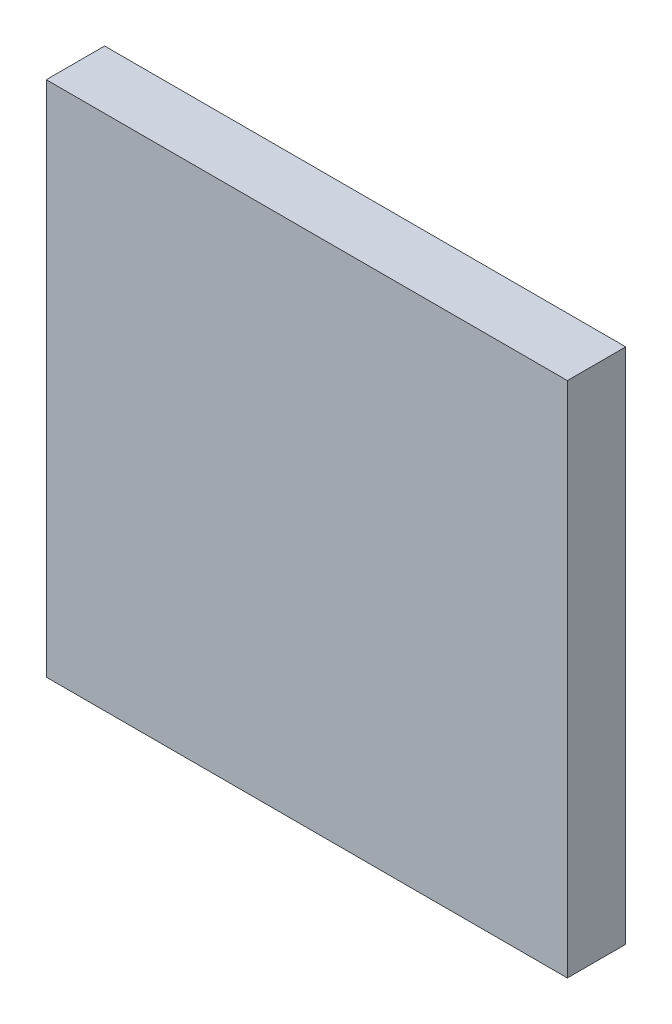
ISO-10303-21;
HEADER;
FILE_DESCRIPTION(('STEP AP214'),'2;1');
FILE_NAME('part.step','',(''),(''),'','','');
FILE_SCHEMA(('AUTOMOTIVE_DESIGN { 1 0 10303 214 1 1 1 1 }'));
ENDSEC;
DATA;
#1=APPLICATION_CONTEXT('core data for automotive mechanical design processes');
#2=APPLICATION_PROTOCOL_DEFINITION('international standard','automotive_design',2000,#1);
#3=PRODUCT_CONTEXT('',#1,'mechanical');
#4=PRODUCT('Part','Part','',(#3));
#5=PRODUCT_RELATED_PRODUCT_CATEGORY('part','',(#4));
#6=PRODUCT_DEFINITION_FORMATION('','',#4);
#7=PRODUCT_DEFINITION_CONTEXT('part definition',#1,'design');
#8=PRODUCT_DEFINITION('design','',#6,#7);
#9=PRODUCT_DEFINITION_SHAPE('','',#8);
#10=(LENGTH_UNIT() NAMED_UNIT(*) SI_UNIT(.MILLI.,.METRE.));
#11=(NAMED_UNIT(*) PLANE_ANGLE_UNIT() SI_UNIT($,.RADIAN.));
#12=(NAMED_UNIT(*) SI_UNIT($,.STERADIAN.) SOLID_ANGLE_UNIT());
#13=UNCERTAINTY_MEASURE_WITH_UNIT(LENGTH_MEASURE(1.E-05),#10,'distance_accuracy_value','');
#14=(GEOMETRIC_REPRESENTATION_CONTEXT(3) GLOBAL_UNCERTAINTY_ASSIGNED_CONTEXT((#13)) GLOBAL_UNIT_ASSIGNED_CONTEXT((#10,
#11,#12)) REPRESENTATION_CONTEXT('',''));
#15=CARTESIAN_POINT('',(0.,0.,0.));
#16=DIRECTION('',(0.,0.,1.));
#17=DIRECTION('',(1.,0.,0.));
#18=AXIS2_PLACEMENT_3D('',#15,#16,#17);
#19=CARTESIAN_POINT('',(-4.4635,-4.4,1.));
#20=DIRECTION('',(1.,0.,0.));
#21=DIRECTION('',(0.,0.,-1.));
#22=AXIS2_PLACEMENT_3D('',#19,#20,#21);
#23=PLANE('',#22);
#24=DIRECTION('',(0.,-1.,0.));
#25=VECTOR('',#24,1.);
#26=CARTESIAN_POINT('',(-4.4635,-4.4,0.));
#27=LINE('',#26,#25);
#28=CARTESIAN_POINT('',(-4.4635,4.4635,0.));
#29=VERTEX_POINT('',#28);
#30=CARTESIAN_POINT('',(-4.4635,-4.4,0.));
#31=VERTEX_POINT('',#30);
#32=EDGE_CURVE('E95',#29,#31,#27,.T.);
#33=ORIENTED_EDGE('',*,*,#32,.T.);
#34=DIRECTION('',(0.,0.,-1.));
#35=VECTOR('',#34,1.);
#36=CARTESIAN_POINT('',(-4.4635,-4.4,1.));
#37=LINE('',#36,#35);
#38=CARTESIAN_POINT('',(-4.4635,-4.4,1.));
#39=VERTEX_POINT('',#38);
#40=EDGE_CURVE('E11',#39,#31,#37,.T.);
#41=ORIENTED_EDGE('',*,*,#40,.F.);
#42=DIRECTION('',(0.,-1.,0.));
#43=VECTOR('',#42,1.);
#44=CARTESIAN_POINT('',(-4.4635,-4.4,1.));
#45=LINE('',#44,#43);
#46=CARTESIAN_POINT('',(-4.4635,4.4635,1.));
#47=VERTEX_POINT('',#46);
#48=EDGE_CURVE('E83',#47,#39,#45,.T.);
#49=ORIENTED_EDGE('',*,*,#48,.F.);
#50=DIRECTION('',(0.,0.,-1.));
#51=VECTOR('',#50,1.);
#52=CARTESIAN_POINT('',(-4.4635,4.4635,1.));
#53=LINE('',#52,#51);
#54=EDGE_CURVE('E91',#47,#29,#53,.T.);
#55=ORIENTED_EDGE('',*,*,#54,.T.);
#56=EDGE_LOOP('',(#33,#41,#49,#55));
#57=FACE_BOUND('',#56,.T.);
#58=ADVANCED_FACE('F32',(#57),#23,.F.);
#59=CARTESIAN_POINT('',(4.4635,-4.4,1.));
#60=DIRECTION('',(0.,1.,0.));
#61=DIRECTION('',(0.,0.,1.));
#62=AXIS2_PLACEMENT_3D('',#59,#60,#61);
#63=PLANE('',#62);
#64=DIRECTION('',(1.,0.,0.));
#65=VECTOR('',#64,1.);
#66=CARTESIAN_POINT('',(4.4635,-4.4,0.));
#67=LINE('',#66,#65);
#68=CARTESIAN_POINT('',(4.4635,-4.4,0.));
#69=VERTEX_POINT('',#68);
#70=EDGE_CURVE('E87',#31,#69,#67,.T.);
#71=ORIENTED_EDGE('',*,*,#70,.T.);
#72=DIRECTION('',(0.,0.,-1.));
#73=VECTOR('',#72,1.);
#74=CARTESIAN_POINT('',(4.4635,-4.4,1.));
#75=LINE('',#74,#73);
#76=CARTESIAN_POINT('',(4.4635,-4.4,1.));
#77=VERTEX_POINT('',#76);
#78=EDGE_CURVE('E40',#77,#69,#75,.T.);
#79=ORIENTED_EDGE('',*,*,#78,.F.);
#80=DIRECTION('',(1.,0.,0.));
#81=VECTOR('',#80,1.);
#82=CARTESIAN_POINT('',(4.4635,-4.4,1.));
#83=LINE('',#82,#81);
#84=EDGE_CURVE('E78',#39,#77,#83,.T.);
#85=ORIENTED_EDGE('',*,*,#84,.F.);
#86=ORIENTED_EDGE('',*,*,#40,.T.);
#87=EDGE_LOOP('',(#71,#79,#85,#86));
#88=FACE_BOUND('',#87,.T.);
#89=ADVANCED_FACE('F86',(#88),#63,.F.);
#90=CARTESIAN_POINT('',(4.4635,4.4635,1.));
#91=DIRECTION('',(-1.,0.,0.));
#92=DIRECTION('',(0.,0.,1.));
#93=AXIS2_PLACEMENT_3D('',#90,#91,#92);
#94=PLANE('',#93);
#95=DIRECTION('',(0.,1.,0.));
#96=VECTOR('',#95,1.);
#97=CARTESIAN_POINT('',(4.4635,4.4635,0.));
#98=LINE('',#97,#96);
#99=CARTESIAN_POINT('',(4.4635,4.4635,0.));
#100=VERTEX_POINT('',#99);
#101=EDGE_CURVE('E65',#69,#100,#98,.T.);
#102=ORIENTED_EDGE('',*,*,#101,.T.);
#103=DIRECTION('',(0.,0.,-1.));
#104=VECTOR('',#103,1.);
#105=CARTESIAN_POINT('',(4.4635,4.4635,1.));
#106=LINE('',#105,#104);
#107=CARTESIAN_POINT('',(4.4635,4.4635,1.));
#108=VERTEX_POINT('',#107);
#109=EDGE_CURVE('E88',#108,#100,#106,.T.);
#110=ORIENTED_EDGE('',*,*,#109,.F.);
#111=DIRECTION('',(0.,1.,0.));
#112=VECTOR('',#111,1.);
#113=CARTESIAN_POINT('',(4.4635,4.4635,1.));
#114=LINE('',#113,#112);
#115=EDGE_CURVE('E81',#77,#108,#114,.T.);
#116=ORIENTED_EDGE('',*,*,#115,.F.);
#117=ORIENTED_EDGE('',*,*,#78,.T.);
#118=EDGE_LOOP('',(#102,#110,#116,#117));
#119=FACE_BOUND('',#118,.T.);
#120=ADVANCED_FACE('F89',(#119),#94,.F.);
#121=CARTESIAN_POINT('',(-4.4635,4.4635,1.));
#122=DIRECTION('',(0.,-1.,0.));
#123=DIRECTION('',(0.,0.,-1.));
#124=AXIS2_PLACEMENT_3D('',#121,#122,#123);
#125=PLANE('',#124);
#126=DIRECTION('',(-1.,0.,0.));
#127=VECTOR('',#126,1.);
#128=CARTESIAN_POINT('',(-4.4635,4.4635,0.));
#129=LINE('',#128,#127);
#130=EDGE_CURVE('E71',#100,#29,#129,.T.);
#131=ORIENTED_EDGE('',*,*,#130,.T.);
#132=ORIENTED_EDGE('',*,*,#54,.F.);
#133=DIRECTION('',(-1.,0.,0.));
#134=VECTOR('',#133,1.);
#135=CARTESIAN_POINT('',(-4.4635,4.4635,1.));
#136=LINE('',#135,#134);
#137=EDGE_CURVE('E48',#108,#47,#136,.T.);
#138=ORIENTED_EDGE('',*,*,#137,.F.);
#139=ORIENTED_EDGE('',*,*,#109,.T.);
#140=EDGE_LOOP('',(#131,#132,#138,#139));
#141=FACE_BOUND('',#140,.T.);
#142=ADVANCED_FACE('F102',(#141),#125,.F.);
#143=CARTESIAN_POINT('',(0.,0.,1.));
#144=DIRECTION('',(0.,0.,-1.));
#145=DIRECTION('',(-1.,0.,0.));
#146=AXIS2_PLACEMENT_3D('',#143,#144,#145);
#147=PLANE('',#146);
#148=ORIENTED_EDGE('',*,*,#48,.T.);
#149=ORIENTED_EDGE('',*,*,#84,.T.);
#150=ORIENTED_EDGE('',*,*,#115,.T.);
#151=ORIENTED_EDGE('',*,*,#137,.T.);
#152=EDGE_LOOP('',(#148,#149,#150,#151));
#153=FACE_BOUND('',#152,.T.);
#154=ADVANCED_FACE('F79',(#153),#147,.F.);
#155=CARTESIAN_POINT('',(0.,0.,0.));
#156=DIRECTION('',(0.,0.,-1.));
#157=DIRECTION('',(-1.,0.,0.));
#158=AXIS2_PLACEMENT_3D('',#155,#156,#157);
#159=PLANE('',#158);
#160=ORIENTED_EDGE('',*,*,#32,.F.);
#161=ORIENTED_EDGE('',*,*,#130,.F.);
#162=ORIENTED_EDGE('',*,*,#101,.F.);
#163=ORIENTED_EDGE('',*,*,#70,.F.);
#164=EDGE_LOOP('',(#160,#161,#162,#163));
#165=FACE_BOUND('',#164,.T.);
#166=ADVANCED_FACE('F105',(#165),#159,.T.);
#167=CLOSED_SHELL('',(#58,#89,#120,#142,#154,#166));
#168=MANIFOLD_SOLID_BREP('B2',#167);
#169=ADVANCED_BREP_SHAPE_REPRESENTATION('',(#18,#168),#14);
#170=SHAPE_DEFINITION_REPRESENTATION(#9,#169);
ENDSEC;
END-ISO-10303-21;
